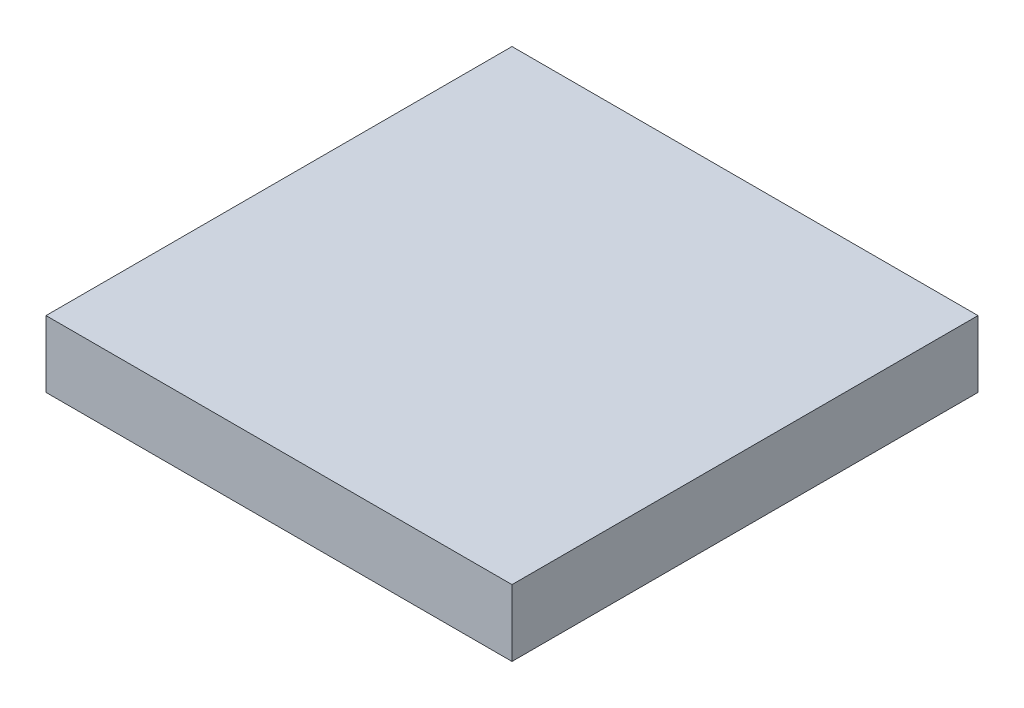
ISO-10303-21;
HEADER;
FILE_DESCRIPTION(('STEP AP214'),'2;1');
FILE_NAME('part.step','',(''),(''),'','','');
FILE_SCHEMA(('AUTOMOTIVE_DESIGN { 1 0 10303 214 1 1 1 1 }'));
ENDSEC;
DATA;
#1=APPLICATION_CONTEXT('core data for automotive mechanical design processes');
#2=APPLICATION_PROTOCOL_DEFINITION('international standard','automotive_design',2000,#1);
#3=PRODUCT_CONTEXT('',#1,'mechanical');
#4=PRODUCT('Part','Part','',(#3));
#5=PRODUCT_RELATED_PRODUCT_CATEGORY('part','',(#4));
#6=PRODUCT_DEFINITION_FORMATION('','',#4);
#7=PRODUCT_DEFINITION_CONTEXT('part definition',#1,'design');
#8=PRODUCT_DEFINITION('design','',#6,#7);
#9=PRODUCT_DEFINITION_SHAPE('','',#8);
#10=(LENGTH_UNIT() NAMED_UNIT(*) SI_UNIT(.MILLI.,.METRE.));
#11=(NAMED_UNIT(*) PLANE_ANGLE_UNIT() SI_UNIT($,.RADIAN.));
#12=(NAMED_UNIT(*) SI_UNIT($,.STERADIAN.) SOLID_ANGLE_UNIT());
#13=UNCERTAINTY_MEASURE_WITH_UNIT(LENGTH_MEASURE(1.E-05),#10,'distance_accuracy_value','');
#14=(GEOMETRIC_REPRESENTATION_CONTEXT(3) GLOBAL_UNCERTAINTY_ASSIGNED_CONTEXT((#13)) GLOBAL_UNIT_ASSIGNED_CONTEXT((#10,
#11,#12)) REPRESENTATION_CONTEXT('',''));
#15=CARTESIAN_POINT('',(0.,0.,0.));
#16=DIRECTION('',(0.,0.,1.));
#17=DIRECTION('',(1.,0.,0.));
#18=AXIS2_PLACEMENT_3D('',#15,#16,#17);
#19=CARTESIAN_POINT('',(8.275,1.85,-15.7));
#20=DIRECTION('',(0.,1.,0.));
#21=DIRECTION('',(1.,0.,0.));
#22=AXIS2_PLACEMENT_3D('',#19,#20,#21);
#23=PLANE('',#22);
#24=DIRECTION('',(0.,0.,1.));
#25=VECTOR('',#24,1.);
#26=CARTESIAN_POINT('',(15.275,1.85,-19.2));
#27=LINE('',#26,#25);
#28=CARTESIAN_POINT('',(15.275,1.85,-22.7));
#29=VERTEX_POINT('',#28);
#30=CARTESIAN_POINT('',(15.275,1.85,-15.7));
#31=VERTEX_POINT('',#30);
#32=EDGE_CURVE('E54',#29,#31,#27,.T.);
#33=ORIENTED_EDGE('',*,*,#32,.F.);
#34=DIRECTION('',(1.,0.,0.));
#35=VECTOR('',#34,1.);
#36=CARTESIAN_POINT('',(11.775,1.85,-22.7));
#37=LINE('',#36,#35);
#38=CARTESIAN_POINT('',(8.275,1.85,-22.7));
#39=VERTEX_POINT('',#38);
#40=EDGE_CURVE('E69',#39,#29,#37,.T.);
#41=ORIENTED_EDGE('',*,*,#40,.F.);
#42=DIRECTION('',(0.,0.,-1.));
#43=VECTOR('',#42,1.);
#44=CARTESIAN_POINT('',(8.275,1.85,-19.2));
#45=LINE('',#44,#43);
#46=CARTESIAN_POINT('',(8.275,1.85,-15.7));
#47=VERTEX_POINT('',#46);
#48=EDGE_CURVE('E21',#47,#39,#45,.T.);
#49=ORIENTED_EDGE('',*,*,#48,.F.);
#50=DIRECTION('',(-1.,0.,0.));
#51=VECTOR('',#50,1.);
#52=CARTESIAN_POINT('',(11.775,1.85,-15.7));
#53=LINE('',#52,#51);
#54=EDGE_CURVE('E59',#31,#47,#53,.T.);
#55=ORIENTED_EDGE('',*,*,#54,.F.);
#56=EDGE_LOOP('',(#33,#41,#49,#55));
#57=FACE_BOUND('',#56,.T.);
#58=ADVANCED_FACE('F17',(#57),#23,.T.);
#59=CARTESIAN_POINT('',(8.275,0.85,-22.7));
#60=DIRECTION('',(-1.,0.,0.));
#61=DIRECTION('',(0.,0.,1.));
#62=AXIS2_PLACEMENT_3D('',#59,#60,#61);
#63=PLANE('',#62);
#64=ORIENTED_EDGE('',*,*,#48,.T.);
#65=DIRECTION('',(0.,1.,0.));
#66=VECTOR('',#65,1.);
#67=CARTESIAN_POINT('',(8.275,1.35,-22.7));
#68=LINE('',#67,#66);
#69=CARTESIAN_POINT('',(8.275,0.85,-22.7));
#70=VERTEX_POINT('',#69);
#71=EDGE_CURVE('E80',#70,#39,#68,.T.);
#72=ORIENTED_EDGE('',*,*,#71,.F.);
#73=DIRECTION('',(0.,0.,1.));
#74=VECTOR('',#73,1.);
#75=CARTESIAN_POINT('',(8.275,0.85,-19.2));
#76=LINE('',#75,#74);
#77=CARTESIAN_POINT('',(8.275,0.85,-15.7));
#78=VERTEX_POINT('',#77);
#79=EDGE_CURVE('E75',#70,#78,#76,.T.);
#80=ORIENTED_EDGE('',*,*,#79,.T.);
#81=DIRECTION('',(0.,-1.,0.));
#82=VECTOR('',#81,1.);
#83=CARTESIAN_POINT('',(8.275,1.35,-15.7));
#84=LINE('',#83,#82);
#85=EDGE_CURVE('E64',#47,#78,#84,.T.);
#86=ORIENTED_EDGE('',*,*,#85,.F.);
#87=EDGE_LOOP('',(#64,#72,#80,#86));
#88=FACE_BOUND('',#87,.T.);
#89=ADVANCED_FACE('F74',(#88),#63,.T.);
#90=CARTESIAN_POINT('',(8.275,0.85,-15.7));
#91=DIRECTION('',(0.,0.,1.));
#92=DIRECTION('',(1.,0.,0.));
#93=AXIS2_PLACEMENT_3D('',#90,#91,#92);
#94=PLANE('',#93);
#95=ORIENTED_EDGE('',*,*,#54,.T.);
#96=ORIENTED_EDGE('',*,*,#85,.T.);
#97=DIRECTION('',(1.,0.,0.));
#98=VECTOR('',#97,1.);
#99=CARTESIAN_POINT('',(11.775,0.85,-15.7));
#100=LINE('',#99,#98);
#101=CARTESIAN_POINT('',(15.275,0.85,-15.7));
#102=VERTEX_POINT('',#101);
#103=EDGE_CURVE('E85',#78,#102,#100,.T.);
#104=ORIENTED_EDGE('',*,*,#103,.T.);
#105=DIRECTION('',(0.,-1.,0.));
#106=VECTOR('',#105,1.);
#107=CARTESIAN_POINT('',(15.275,1.35,-15.7));
#108=LINE('',#107,#106);
#109=EDGE_CURVE('E66',#31,#102,#108,.T.);
#110=ORIENTED_EDGE('',*,*,#109,.F.);
#111=EDGE_LOOP('',(#95,#96,#104,#110));
#112=FACE_BOUND('',#111,.T.);
#113=ADVANCED_FACE('F61',(#112),#94,.T.);
#114=CARTESIAN_POINT('',(15.275,0.85,-15.7));
#115=DIRECTION('',(1.,0.,0.));
#116=DIRECTION('',(0.,0.,-1.));
#117=AXIS2_PLACEMENT_3D('',#114,#115,#116);
#118=PLANE('',#117);
#119=ORIENTED_EDGE('',*,*,#32,.T.);
#120=ORIENTED_EDGE('',*,*,#109,.T.);
#121=DIRECTION('',(0.,0.,-1.));
#122=VECTOR('',#121,1.);
#123=CARTESIAN_POINT('',(15.275,0.85,-19.2));
#124=LINE('',#123,#122);
#125=CARTESIAN_POINT('',(15.275,0.85,-22.7));
#126=VERTEX_POINT('',#125);
#127=EDGE_CURVE('E27',#102,#126,#124,.T.);
#128=ORIENTED_EDGE('',*,*,#127,.T.);
#129=DIRECTION('',(0.,-1.,0.));
#130=VECTOR('',#129,1.);
#131=CARTESIAN_POINT('',(15.275,1.35,-22.7));
#132=LINE('',#131,#130);
#133=EDGE_CURVE('E35',#29,#126,#132,.T.);
#134=ORIENTED_EDGE('',*,*,#133,.F.);
#135=EDGE_LOOP('',(#119,#120,#128,#134));
#136=FACE_BOUND('',#135,.T.);
#137=ADVANCED_FACE('F89',(#136),#118,.T.);
#138=CARTESIAN_POINT('',(15.275,0.85,-22.7));
#139=DIRECTION('',(0.,0.,-1.));
#140=DIRECTION('',(-1.,0.,0.));
#141=AXIS2_PLACEMENT_3D('',#138,#139,#140);
#142=PLANE('',#141);
#143=ORIENTED_EDGE('',*,*,#40,.T.);
#144=ORIENTED_EDGE('',*,*,#133,.T.);
#145=DIRECTION('',(-1.,0.,0.));
#146=VECTOR('',#145,1.);
#147=CARTESIAN_POINT('',(11.775,0.85,-22.7));
#148=LINE('',#147,#146);
#149=EDGE_CURVE('E11',#126,#70,#148,.T.);
#150=ORIENTED_EDGE('',*,*,#149,.T.);
#151=ORIENTED_EDGE('',*,*,#71,.T.);
#152=EDGE_LOOP('',(#143,#144,#150,#151));
#153=FACE_BOUND('',#152,.T.);
#154=ADVANCED_FACE('F91',(#153),#142,.T.);
#155=CARTESIAN_POINT('',(8.275,0.85,-15.7));
#156=DIRECTION('',(0.,1.,0.));
#157=DIRECTION('',(1.,0.,0.));
#158=AXIS2_PLACEMENT_3D('',#155,#156,#157);
#159=PLANE('',#158);
#160=ORIENTED_EDGE('',*,*,#127,.F.);
#161=ORIENTED_EDGE('',*,*,#103,.F.);
#162=ORIENTED_EDGE('',*,*,#79,.F.);
#163=ORIENTED_EDGE('',*,*,#149,.F.);
#164=EDGE_LOOP('',(#160,#161,#162,#163));
#165=FACE_BOUND('',#164,.T.);
#166=ADVANCED_FACE('F19',(#165),#159,.F.);
#167=CLOSED_SHELL('',(#58,#89,#113,#137,#154,#166));
#168=MANIFOLD_SOLID_BREP('B1',#167);
#169=ADVANCED_BREP_SHAPE_REPRESENTATION('',(#18,#168),#14);
#170=SHAPE_DEFINITION_REPRESENTATION(#9,#169);
ENDSEC;
END-ISO-10303-21;
